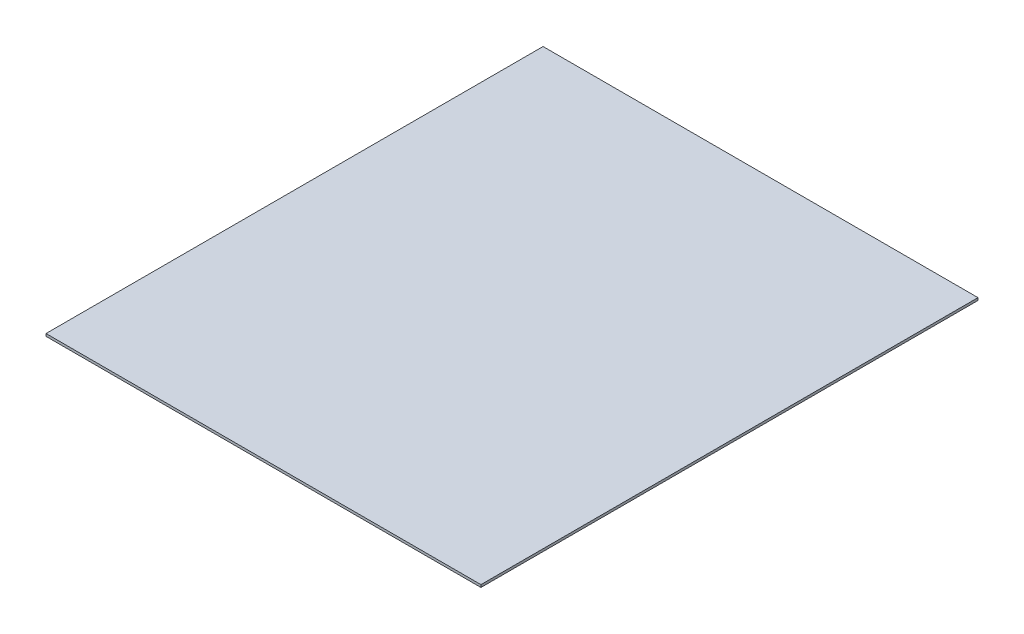
ISO-10303-21;
HEADER;
FILE_DESCRIPTION(('STEP AP214'),'2;1');
FILE_NAME('part.step','',(''),(''),'','','');
FILE_SCHEMA(('AUTOMOTIVE_DESIGN { 1 0 10303 214 1 1 1 1 }'));
ENDSEC;
DATA;
#1=APPLICATION_CONTEXT('core data for automotive mechanical design processes');
#2=APPLICATION_PROTOCOL_DEFINITION('international standard','automotive_design',2000,#1);
#3=PRODUCT_CONTEXT('',#1,'mechanical');
#4=PRODUCT('Part','Part','',(#3));
#5=PRODUCT_RELATED_PRODUCT_CATEGORY('part','',(#4));
#6=PRODUCT_DEFINITION_FORMATION('','',#4);
#7=PRODUCT_DEFINITION_CONTEXT('part definition',#1,'design');
#8=PRODUCT_DEFINITION('design','',#6,#7);
#9=PRODUCT_DEFINITION_SHAPE('','',#8);
#10=(LENGTH_UNIT() NAMED_UNIT(*) SI_UNIT(.MILLI.,.METRE.));
#11=(NAMED_UNIT(*) PLANE_ANGLE_UNIT() SI_UNIT($,.RADIAN.));
#12=(NAMED_UNIT(*) SI_UNIT($,.STERADIAN.) SOLID_ANGLE_UNIT());
#13=UNCERTAINTY_MEASURE_WITH_UNIT(LENGTH_MEASURE(1.E-05),#10,'distance_accuracy_value','');
#14=(GEOMETRIC_REPRESENTATION_CONTEXT(3) GLOBAL_UNCERTAINTY_ASSIGNED_CONTEXT((#13)) GLOBAL_UNIT_ASSIGNED_CONTEXT((#10,
#11,#12)) REPRESENTATION_CONTEXT('',''));
#15=CARTESIAN_POINT('',(0.,0.,0.));
#16=DIRECTION('',(0.,0.,1.));
#17=DIRECTION('',(1.,0.,0.));
#18=AXIS2_PLACEMENT_3D('',#15,#16,#17);
#19=CARTESIAN_POINT('',(175.,0.,200.));
#20=DIRECTION('',(0.,0.,-1.));
#21=DIRECTION('',(-1.,0.,0.));
#22=AXIS2_PLACEMENT_3D('',#19,#20,#21);
#23=PLANE('',#22);
#24=DIRECTION('',(0.,-1.,0.));
#25=VECTOR('',#24,1.);
#26=CARTESIAN_POINT('',(-175.,0.,200.));
#27=LINE('',#26,#25);
#28=CARTESIAN_POINT('',(-175.,0.,200.));
#29=VERTEX_POINT('',#28);
#30=CARTESIAN_POINT('',(-175.,-2.,200.));
#31=VERTEX_POINT('',#30);
#32=EDGE_CURVE('E97',#29,#31,#27,.T.);
#33=ORIENTED_EDGE('',*,*,#32,.T.);
#34=DIRECTION('',(-1.,0.,0.));
#35=VECTOR('',#34,1.);
#36=CARTESIAN_POINT('',(175.,-2.,200.));
#37=LINE('',#36,#35);
#38=CARTESIAN_POINT('',(175.,-2.,200.));
#39=VERTEX_POINT('',#38);
#40=EDGE_CURVE('E11',#39,#31,#37,.T.);
#41=ORIENTED_EDGE('',*,*,#40,.F.);
#42=DIRECTION('',(0.,-1.,0.));
#43=VECTOR('',#42,1.);
#44=CARTESIAN_POINT('',(175.,0.,200.));
#45=LINE('',#44,#43);
#46=CARTESIAN_POINT('',(175.,0.,200.));
#47=VERTEX_POINT('',#46);
#48=EDGE_CURVE('E85',#47,#39,#45,.T.);
#49=ORIENTED_EDGE('',*,*,#48,.F.);
#50=DIRECTION('',(-1.,0.,0.));
#51=VECTOR('',#50,1.);
#52=CARTESIAN_POINT('',(175.,0.,200.));
#53=LINE('',#52,#51);
#54=EDGE_CURVE('E93',#47,#29,#53,.T.);
#55=ORIENTED_EDGE('',*,*,#54,.T.);
#56=EDGE_LOOP('',(#33,#41,#49,#55));
#57=FACE_BOUND('',#56,.T.);
#58=ADVANCED_FACE('F34',(#57),#23,.F.);
#59=CARTESIAN_POINT('',(175.,-2.,200.));
#60=DIRECTION('',(0.,1.,0.));
#61=DIRECTION('',(0.,0.,1.));
#62=AXIS2_PLACEMENT_3D('',#59,#60,#61);
#63=PLANE('',#62);
#64=DIRECTION('',(0.,0.,-1.));
#65=VECTOR('',#64,1.);
#66=CARTESIAN_POINT('',(-175.,-2.,200.));
#67=LINE('',#66,#65);
#68=CARTESIAN_POINT('',(-175.,-2.,-200.));
#69=VERTEX_POINT('',#68);
#70=EDGE_CURVE('E89',#31,#69,#67,.T.);
#71=ORIENTED_EDGE('',*,*,#70,.T.);
#72=DIRECTION('',(-1.,0.,0.));
#73=VECTOR('',#72,1.);
#74=CARTESIAN_POINT('',(175.,-2.,-200.));
#75=LINE('',#74,#73);
#76=CARTESIAN_POINT('',(175.,-2.,-200.));
#77=VERTEX_POINT('',#76);
#78=EDGE_CURVE('E42',#77,#69,#75,.T.);
#79=ORIENTED_EDGE('',*,*,#78,.F.);
#80=DIRECTION('',(0.,0.,-1.));
#81=VECTOR('',#80,1.);
#82=CARTESIAN_POINT('',(175.,-2.,200.));
#83=LINE('',#82,#81);
#84=EDGE_CURVE('E80',#39,#77,#83,.T.);
#85=ORIENTED_EDGE('',*,*,#84,.F.);
#86=ORIENTED_EDGE('',*,*,#40,.T.);
#87=EDGE_LOOP('',(#71,#79,#85,#86));
#88=FACE_BOUND('',#87,.T.);
#89=ADVANCED_FACE('F88',(#88),#63,.F.);
#90=CARTESIAN_POINT('',(175.,0.,-200.));
#91=DIRECTION('',(0.,0.,1.));
#92=DIRECTION('',(1.,0.,0.));
#93=AXIS2_PLACEMENT_3D('',#90,#91,#92);
#94=PLANE('',#93);
#95=DIRECTION('',(0.,1.,0.));
#96=VECTOR('',#95,1.);
#97=CARTESIAN_POINT('',(-175.,0.,-200.));
#98=LINE('',#97,#96);
#99=CARTESIAN_POINT('',(-175.,0.,-200.));
#100=VERTEX_POINT('',#99);
#101=EDGE_CURVE('E67',#69,#100,#98,.T.);
#102=ORIENTED_EDGE('',*,*,#101,.T.);
#103=DIRECTION('',(-1.,0.,0.));
#104=VECTOR('',#103,1.);
#105=CARTESIAN_POINT('',(175.,0.,-200.));
#106=LINE('',#105,#104);
#107=CARTESIAN_POINT('',(175.,0.,-200.));
#108=VERTEX_POINT('',#107);
#109=EDGE_CURVE('E90',#108,#100,#106,.T.);
#110=ORIENTED_EDGE('',*,*,#109,.F.);
#111=DIRECTION('',(0.,1.,0.));
#112=VECTOR('',#111,1.);
#113=CARTESIAN_POINT('',(175.,0.,-200.));
#114=LINE('',#113,#112);
#115=EDGE_CURVE('E83',#77,#108,#114,.T.);
#116=ORIENTED_EDGE('',*,*,#115,.F.);
#117=ORIENTED_EDGE('',*,*,#78,.T.);
#118=EDGE_LOOP('',(#102,#110,#116,#117));
#119=FACE_BOUND('',#118,.T.);
#120=ADVANCED_FACE('F91',(#119),#94,.F.);
#121=CARTESIAN_POINT('',(175.,0.,200.));
#122=DIRECTION('',(0.,-1.,0.));
#123=DIRECTION('',(0.,0.,-1.));
#124=AXIS2_PLACEMENT_3D('',#121,#122,#123);
#125=PLANE('',#124);
#126=DIRECTION('',(0.,0.,1.));
#127=VECTOR('',#126,1.);
#128=CARTESIAN_POINT('',(-175.,0.,200.));
#129=LINE('',#128,#127);
#130=EDGE_CURVE('E73',#100,#29,#129,.T.);
#131=ORIENTED_EDGE('',*,*,#130,.T.);
#132=ORIENTED_EDGE('',*,*,#54,.F.);
#133=DIRECTION('',(0.,0.,1.));
#134=VECTOR('',#133,1.);
#135=CARTESIAN_POINT('',(175.,0.,200.));
#136=LINE('',#135,#134);
#137=EDGE_CURVE('E50',#108,#47,#136,.T.);
#138=ORIENTED_EDGE('',*,*,#137,.F.);
#139=ORIENTED_EDGE('',*,*,#109,.T.);
#140=EDGE_LOOP('',(#131,#132,#138,#139));
#141=FACE_BOUND('',#140,.T.);
#142=ADVANCED_FACE('F104',(#141),#125,.F.);
#143=CARTESIAN_POINT('',(175.,0.,0.));
#144=DIRECTION('',(1.,0.,0.));
#145=DIRECTION('',(0.,0.,-1.));
#146=AXIS2_PLACEMENT_3D('',#143,#144,#145);
#147=PLANE('',#146);
#148=ORIENTED_EDGE('',*,*,#48,.T.);
#149=ORIENTED_EDGE('',*,*,#84,.T.);
#150=ORIENTED_EDGE('',*,*,#115,.T.);
#151=ORIENTED_EDGE('',*,*,#137,.T.);
#152=EDGE_LOOP('',(#148,#149,#150,#151));
#153=FACE_BOUND('',#152,.T.);
#154=ADVANCED_FACE('F81',(#153),#147,.T.);
#155=CARTESIAN_POINT('',(-175.,0.,0.));
#156=DIRECTION('',(1.,0.,0.));
#157=DIRECTION('',(0.,0.,-1.));
#158=AXIS2_PLACEMENT_3D('',#155,#156,#157);
#159=PLANE('',#158);
#160=ORIENTED_EDGE('',*,*,#32,.F.);
#161=ORIENTED_EDGE('',*,*,#130,.F.);
#162=ORIENTED_EDGE('',*,*,#101,.F.);
#163=ORIENTED_EDGE('',*,*,#70,.F.);
#164=EDGE_LOOP('',(#160,#161,#162,#163));
#165=FACE_BOUND('',#164,.T.);
#166=ADVANCED_FACE('F107',(#165),#159,.F.);
#167=CLOSED_SHELL('',(#58,#89,#120,#142,#154,#166));
#168=MANIFOLD_SOLID_BREP('B2',#167);
#169=ADVANCED_BREP_SHAPE_REPRESENTATION('',(#18,#168),#14);
#170=SHAPE_DEFINITION_REPRESENTATION(#9,#169);
ENDSEC;
END-ISO-10303-21;
